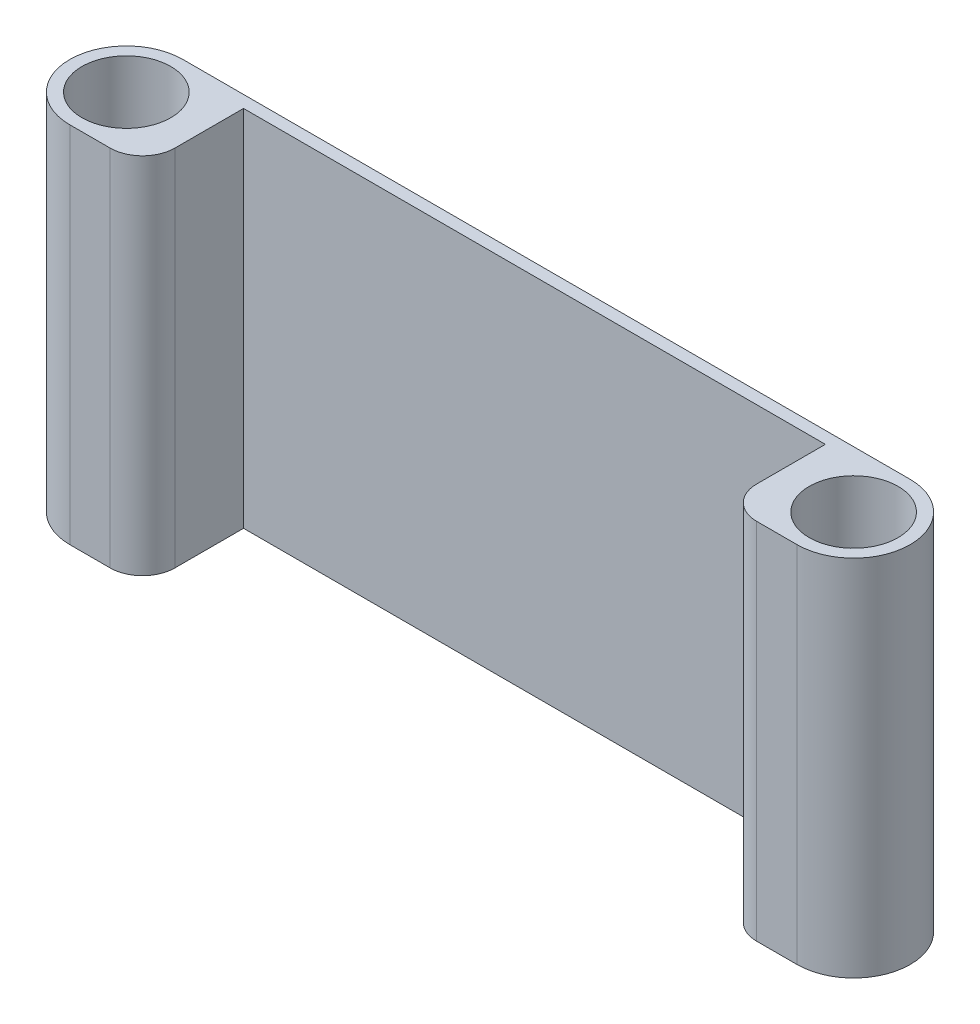
ISO-10303-21;
HEADER;
FILE_DESCRIPTION(('STEP AP214'),'2;1');
FILE_NAME('part.step','',(''),(''),'','','');
FILE_SCHEMA(('AUTOMOTIVE_DESIGN { 1 0 10303 214 1 1 1 1 }'));
ENDSEC;
DATA;
#1=APPLICATION_CONTEXT('core data for automotive mechanical design processes');
#2=APPLICATION_PROTOCOL_DEFINITION('international standard','automotive_design',2000,#1);
#3=PRODUCT_CONTEXT('',#1,'mechanical');
#4=PRODUCT('Part','Part','',(#3));
#5=PRODUCT_RELATED_PRODUCT_CATEGORY('part','',(#4));
#6=PRODUCT_DEFINITION_FORMATION('','',#4);
#7=PRODUCT_DEFINITION_CONTEXT('part definition',#1,'design');
#8=PRODUCT_DEFINITION('design','',#6,#7);
#9=PRODUCT_DEFINITION_SHAPE('','',#8);
#10=(LENGTH_UNIT() NAMED_UNIT(*) SI_UNIT(.MILLI.,.METRE.));
#11=(NAMED_UNIT(*) PLANE_ANGLE_UNIT() SI_UNIT($,.RADIAN.));
#12=(NAMED_UNIT(*) SI_UNIT($,.STERADIAN.) SOLID_ANGLE_UNIT());
#13=UNCERTAINTY_MEASURE_WITH_UNIT(LENGTH_MEASURE(1.E-05),#10,'distance_accuracy_value','');
#14=(GEOMETRIC_REPRESENTATION_CONTEXT(3) GLOBAL_UNCERTAINTY_ASSIGNED_CONTEXT((#13)) GLOBAL_UNIT_ASSIGNED_CONTEXT((#10,
#11,#12)) REPRESENTATION_CONTEXT('',''));
#15=CARTESIAN_POINT('',(0.,0.,0.));
#16=DIRECTION('',(0.,0.,1.));
#17=DIRECTION('',(1.,0.,0.));
#18=AXIS2_PLACEMENT_3D('',#15,#16,#17);
#19=CARTESIAN_POINT('',(-42.5394184422842,90.,0.499999999999994));
#20=DIRECTION('',(0.,-1.,0.));
#21=DIRECTION('',(0.,0.,-1.));
#22=AXIS2_PLACEMENT_3D('',#19,#20,#21);
#23=PLANE('',#22);
#24=DIRECTION('',(0.,0.,1.));
#25=VECTOR('',#24,1.);
#26=CARTESIAN_POINT('',(119.460581557716,90.,14.5));
#27=LINE('',#26,#25);
#28=CARTESIAN_POINT('',(119.460581557716,90.,-10.5));
#29=VERTEX_POINT('',#28);
#30=CARTESIAN_POINT('',(119.460581557716,90.,6.50000000000001));
#31=VERTEX_POINT('',#30);
#32=EDGE_CURVE('E189',#29,#31,#27,.T.);
#33=ORIENTED_EDGE('',*,*,#32,.T.);
#34=CARTESIAN_POINT('',(127.460581557716,90.,6.50000000000001));
#35=DIRECTION('',(0.,-1.,0.));
#36=DIRECTION('',(0.,0.,-1.));
#37=AXIS2_PLACEMENT_3D('',#34,#35,#36);
#38=CIRCLE('',#37,8.);
#39=CARTESIAN_POINT('',(127.460581557716,90.,14.5));
#40=VERTEX_POINT('',#39);
#41=EDGE_CURVE('E146',#31,#40,#38,.F.);
#42=ORIENTED_EDGE('',*,*,#41,.T.);
#43=DIRECTION('',(1.,0.,0.));
#44=VECTOR('',#43,1.);
#45=CARTESIAN_POINT('',(137.460581557716,90.,14.5));
#46=LINE('',#45,#44);
#47=CARTESIAN_POINT('',(137.460581557716,90.,14.5));
#48=VERTEX_POINT('',#47);
#49=EDGE_CURVE('E201',#40,#48,#46,.T.);
#50=ORIENTED_EDGE('',*,*,#49,.T.);
#51=CARTESIAN_POINT('',(137.460581557716,90.,0.499999999999994));
#52=DIRECTION('',(0.,1.,0.));
#53=DIRECTION('',(0.,0.,-1.));
#54=AXIS2_PLACEMENT_3D('',#51,#52,#53);
#55=CIRCLE('',#54,14.);
#56=CARTESIAN_POINT('',(137.460581557716,90.,-13.5));
#57=VERTEX_POINT('',#56);
#58=EDGE_CURVE('E203',#48,#57,#55,.T.);
#59=ORIENTED_EDGE('',*,*,#58,.T.);
#60=DIRECTION('',(-1.,0.,0.));
#61=VECTOR('',#60,1.);
#62=CARTESIAN_POINT('',(-42.5394184422842,90.,-13.5));
#63=LINE('',#62,#61);
#64=CARTESIAN_POINT('',(-42.5394184422842,90.,-13.5));
#65=VERTEX_POINT('',#64);
#66=EDGE_CURVE('E120',#57,#65,#63,.T.);
#67=ORIENTED_EDGE('',*,*,#66,.T.);
#68=CARTESIAN_POINT('',(-42.5394184422842,90.,0.499999999999994));
#69=DIRECTION('',(0.,1.,0.));
#70=DIRECTION('',(0.,0.,-1.));
#71=AXIS2_PLACEMENT_3D('',#68,#69,#70);
#72=CIRCLE('',#71,14.);
#73=CARTESIAN_POINT('',(-42.5394184422842,90.,14.5));
#74=VERTEX_POINT('',#73);
#75=EDGE_CURVE('E114',#65,#74,#72,.T.);
#76=ORIENTED_EDGE('',*,*,#75,.T.);
#77=DIRECTION('',(1.,0.,0.));
#78=VECTOR('',#77,1.);
#79=CARTESIAN_POINT('',(-42.5394184422842,90.,14.5));
#80=LINE('',#79,#78);
#81=CARTESIAN_POINT('',(-32.5394184422842,90.,14.5));
#82=VERTEX_POINT('',#81);
#83=EDGE_CURVE('E107',#74,#82,#80,.T.);
#84=ORIENTED_EDGE('',*,*,#83,.T.);
#85=CARTESIAN_POINT('',(-32.5394184422842,90.,6.5));
#86=DIRECTION('',(0.,-1.,0.));
#87=DIRECTION('',(0.,0.,-1.));
#88=AXIS2_PLACEMENT_3D('',#85,#86,#87);
#89=CIRCLE('',#88,8.);
#90=CARTESIAN_POINT('',(-24.5394184422842,90.,6.5));
#91=VERTEX_POINT('',#90);
#92=EDGE_CURVE('E48',#82,#91,#89,.F.);
#93=ORIENTED_EDGE('',*,*,#92,.T.);
#94=DIRECTION('',(0.,0.,-1.));
#95=VECTOR('',#94,1.);
#96=CARTESIAN_POINT('',(-24.5394184422842,90.,14.5));
#97=LINE('',#96,#95);
#98=CARTESIAN_POINT('',(-24.5394184422842,90.,-10.5));
#99=VERTEX_POINT('',#98);
#100=EDGE_CURVE('E113',#91,#99,#97,.T.);
#101=ORIENTED_EDGE('',*,*,#100,.T.);
#102=DIRECTION('',(1.,0.,0.));
#103=VECTOR('',#102,1.);
#104=CARTESIAN_POINT('',(119.460581557716,90.,-10.5));
#105=LINE('',#104,#103);
#106=EDGE_CURVE('E206',#99,#29,#105,.T.);
#107=ORIENTED_EDGE('',*,*,#106,.T.);
#108=EDGE_LOOP('',(#33,#42,#50,#59,#67,#76,#84,#93,#101,#107));
#109=FACE_BOUND('',#108,.T.);
#110=CARTESIAN_POINT('',(-42.5394184422842,90.,0.499999999999994));
#111=DIRECTION('',(0.,1.,0.));
#112=DIRECTION('',(0.,0.,1.));
#113=AXIS2_PLACEMENT_3D('',#110,#111,#112);
#114=CIRCLE('',#113,11.);
#115=CARTESIAN_POINT('',(-42.5394184422842,90.,11.5));
#116=VERTEX_POINT('',#115);
#117=EDGE_CURVE('E210',#116,#116,#114,.T.);
#118=ORIENTED_EDGE('',*,*,#117,.F.);
#119=EDGE_LOOP('',(#118));
#120=FACE_BOUND('',#119,.T.);
#121=CARTESIAN_POINT('',(137.460581557716,90.,0.499999999999994));
#122=DIRECTION('',(0.,1.,0.));
#123=DIRECTION('',(0.,0.,1.));
#124=AXIS2_PLACEMENT_3D('',#121,#122,#123);
#125=CIRCLE('',#124,11.);
#126=CARTESIAN_POINT('',(137.460581557716,90.,11.5));
#127=VERTEX_POINT('',#126);
#128=EDGE_CURVE('E217',#127,#127,#125,.T.);
#129=ORIENTED_EDGE('',*,*,#128,.F.);
#130=EDGE_LOOP('',(#129));
#131=FACE_BOUND('',#130,.T.);
#132=ADVANCED_FACE('F33',(#109,#120,#131),#23,.F.);
#133=CARTESIAN_POINT('',(-42.5394184422842,0.,0.499999999999994));
#134=DIRECTION('',(0.,-1.,0.));
#135=DIRECTION('',(0.,0.,-1.));
#136=AXIS2_PLACEMENT_3D('',#133,#134,#135);
#137=PLANE('',#136);
#138=CARTESIAN_POINT('',(-42.5394184422842,0.,0.499999999999994));
#139=DIRECTION('',(0.,1.,0.));
#140=DIRECTION('',(0.,0.,1.));
#141=AXIS2_PLACEMENT_3D('',#138,#139,#140);
#142=CIRCLE('',#141,11.);
#143=CARTESIAN_POINT('',(-42.5394184422842,0.,11.5));
#144=VERTEX_POINT('',#143);
#145=EDGE_CURVE('E212',#144,#144,#142,.T.);
#146=ORIENTED_EDGE('',*,*,#145,.T.);
#147=EDGE_LOOP('',(#146));
#148=FACE_BOUND('',#147,.T.);
#149=DIRECTION('',(1.,0.,0.));
#150=VECTOR('',#149,1.);
#151=CARTESIAN_POINT('',(137.460581557716,0.,14.5));
#152=LINE('',#151,#150);
#153=CARTESIAN_POINT('',(127.460581557716,0.,14.5));
#154=VERTEX_POINT('',#153);
#155=CARTESIAN_POINT('',(137.460581557716,0.,14.5));
#156=VERTEX_POINT('',#155);
#157=EDGE_CURVE('E171',#154,#156,#152,.T.);
#158=ORIENTED_EDGE('',*,*,#157,.F.);
#159=CARTESIAN_POINT('',(127.460581557716,0.,6.50000000000001));
#160=DIRECTION('',(0.,-1.,0.));
#161=DIRECTION('',(0.,0.,-1.));
#162=AXIS2_PLACEMENT_3D('',#159,#160,#161);
#163=CIRCLE('',#162,8.);
#164=CARTESIAN_POINT('',(119.460581557716,0.,6.50000000000001));
#165=VERTEX_POINT('',#164);
#166=EDGE_CURVE('E141',#154,#165,#163,.T.);
#167=ORIENTED_EDGE('',*,*,#166,.T.);
#168=DIRECTION('',(0.,0.,1.));
#169=VECTOR('',#168,1.);
#170=CARTESIAN_POINT('',(119.460581557716,0.,14.5));
#171=LINE('',#170,#169);
#172=CARTESIAN_POINT('',(119.460581557716,0.,-10.5));
#173=VERTEX_POINT('',#172);
#174=EDGE_CURVE('E164',#173,#165,#171,.T.);
#175=ORIENTED_EDGE('',*,*,#174,.F.);
#176=DIRECTION('',(1.,0.,0.));
#177=VECTOR('',#176,1.);
#178=CARTESIAN_POINT('',(119.460581557716,0.,-10.5));
#179=LINE('',#178,#177);
#180=CARTESIAN_POINT('',(-24.5394184422842,0.,-10.5));
#181=VERTEX_POINT('',#180);
#182=EDGE_CURVE('E161',#181,#173,#179,.T.);
#183=ORIENTED_EDGE('',*,*,#182,.F.);
#184=DIRECTION('',(0.,0.,-1.));
#185=VECTOR('',#184,1.);
#186=CARTESIAN_POINT('',(-24.5394184422842,0.,14.5));
#187=LINE('',#186,#185);
#188=CARTESIAN_POINT('',(-24.5394184422842,0.,6.5));
#189=VERTEX_POINT('',#188);
#190=EDGE_CURVE('E153',#189,#181,#187,.T.);
#191=ORIENTED_EDGE('',*,*,#190,.F.);
#192=CARTESIAN_POINT('',(-32.5394184422842,0.,6.5));
#193=DIRECTION('',(0.,-1.,0.));
#194=DIRECTION('',(0.,0.,-1.));
#195=AXIS2_PLACEMENT_3D('',#192,#193,#194);
#196=CIRCLE('',#195,8.);
#197=CARTESIAN_POINT('',(-32.5394184422842,0.,14.5));
#198=VERTEX_POINT('',#197);
#199=EDGE_CURVE('E133',#189,#198,#196,.T.);
#200=ORIENTED_EDGE('',*,*,#199,.T.);
#201=DIRECTION('',(1.,0.,0.));
#202=VECTOR('',#201,1.);
#203=CARTESIAN_POINT('',(-42.5394184422842,0.,14.5));
#204=LINE('',#203,#202);
#205=CARTESIAN_POINT('',(-42.5394184422842,0.,14.5));
#206=VERTEX_POINT('',#205);
#207=EDGE_CURVE('E162',#206,#198,#204,.T.);
#208=ORIENTED_EDGE('',*,*,#207,.F.);
#209=CARTESIAN_POINT('',(-42.5394184422842,0.,0.499999999999994));
#210=DIRECTION('',(0.,1.,0.));
#211=DIRECTION('',(0.,0.,-1.));
#212=AXIS2_PLACEMENT_3D('',#209,#210,#211);
#213=CIRCLE('',#212,14.);
#214=CARTESIAN_POINT('',(-42.5394184422842,0.,-13.5));
#215=VERTEX_POINT('',#214);
#216=EDGE_CURVE('E128',#215,#206,#213,.T.);
#217=ORIENTED_EDGE('',*,*,#216,.F.);
#218=DIRECTION('',(-1.,0.,0.));
#219=VECTOR('',#218,1.);
#220=CARTESIAN_POINT('',(-42.5394184422842,0.,-13.5));
#221=LINE('',#220,#219);
#222=CARTESIAN_POINT('',(137.460581557716,0.,-13.5));
#223=VERTEX_POINT('',#222);
#224=EDGE_CURVE('E124',#223,#215,#221,.T.);
#225=ORIENTED_EDGE('',*,*,#224,.F.);
#226=CARTESIAN_POINT('',(137.460581557716,0.,0.499999999999994));
#227=DIRECTION('',(0.,1.,0.));
#228=DIRECTION('',(0.,0.,-1.));
#229=AXIS2_PLACEMENT_3D('',#226,#227,#228);
#230=CIRCLE('',#229,14.);
#231=EDGE_CURVE('E173',#156,#223,#230,.T.);
#232=ORIENTED_EDGE('',*,*,#231,.F.);
#233=EDGE_LOOP('',(#158,#167,#175,#183,#191,#200,#208,#217,#225,#232));
#234=FACE_BOUND('',#233,.T.);
#235=CARTESIAN_POINT('',(137.460581557716,0.,0.499999999999994));
#236=DIRECTION('',(0.,1.,0.));
#237=DIRECTION('',(0.,0.,1.));
#238=AXIS2_PLACEMENT_3D('',#235,#236,#237);
#239=CIRCLE('',#238,11.);
#240=CARTESIAN_POINT('',(137.460581557716,0.,11.5));
#241=VERTEX_POINT('',#240);
#242=EDGE_CURVE('E220',#241,#241,#239,.T.);
#243=ORIENTED_EDGE('',*,*,#242,.T.);
#244=EDGE_LOOP('',(#243));
#245=FACE_BOUND('',#244,.T.);
#246=ADVANCED_FACE('F158',(#148,#234,#245),#137,.T.);
#247=CARTESIAN_POINT('',(-42.5394184422842,90.,0.499999999999994));
#248=DIRECTION('',(0.,-1.,0.));
#249=DIRECTION('',(0.,0.,-1.));
#250=AXIS2_PLACEMENT_3D('',#247,#248,#249);
#251=CYLINDRICAL_SURFACE('',#250,14.);
#252=ORIENTED_EDGE('',*,*,#216,.T.);
#253=DIRECTION('',(0.,-1.,0.));
#254=VECTOR('',#253,1.);
#255=CARTESIAN_POINT('',(-42.5394184422842,90.,14.5));
#256=LINE('',#255,#254);
#257=EDGE_CURVE('E111',#74,#206,#256,.T.);
#258=ORIENTED_EDGE('',*,*,#257,.F.);
#259=ORIENTED_EDGE('',*,*,#75,.F.);
#260=DIRECTION('',(0.,-1.,0.));
#261=VECTOR('',#260,1.);
#262=CARTESIAN_POINT('',(-42.5394184422842,90.,-13.5));
#263=LINE('',#262,#261);
#264=EDGE_CURVE('E176',#65,#215,#263,.T.);
#265=ORIENTED_EDGE('',*,*,#264,.T.);
#266=EDGE_LOOP('',(#252,#258,#259,#265));
#267=FACE_BOUND('',#266,.T.);
#268=ADVANCED_FACE('F126',(#267),#251,.T.);
#269=CARTESIAN_POINT('',(-42.5394184422842,90.,14.5));
#270=DIRECTION('',(0.,0.,-1.));
#271=DIRECTION('',(-1.,0.,0.));
#272=AXIS2_PLACEMENT_3D('',#269,#270,#271);
#273=PLANE('',#272);
#274=ORIENTED_EDGE('',*,*,#207,.T.);
#275=DIRECTION('',(0.,-1.,0.));
#276=VECTOR('',#275,1.);
#277=CARTESIAN_POINT('',(-32.5394184422842,90.,14.5));
#278=LINE('',#277,#276);
#279=EDGE_CURVE('E11',#198,#82,#278,.F.);
#280=ORIENTED_EDGE('',*,*,#279,.T.);
#281=ORIENTED_EDGE('',*,*,#83,.F.);
#282=ORIENTED_EDGE('',*,*,#257,.T.);
#283=EDGE_LOOP('',(#274,#280,#281,#282));
#284=FACE_BOUND('',#283,.T.);
#285=ADVANCED_FACE('F109',(#284),#273,.F.);
#286=CARTESIAN_POINT('',(-24.5394184422842,90.,14.5));
#287=DIRECTION('',(-1.,0.,0.));
#288=DIRECTION('',(0.,0.,1.));
#289=AXIS2_PLACEMENT_3D('',#286,#287,#288);
#290=PLANE('',#289);
#291=ORIENTED_EDGE('',*,*,#100,.F.);
#292=DIRECTION('',(0.,-1.,0.));
#293=VECTOR('',#292,1.);
#294=CARTESIAN_POINT('',(-24.5394184422842,90.,6.5));
#295=LINE('',#294,#293);
#296=EDGE_CURVE('E41',#91,#189,#295,.T.);
#297=ORIENTED_EDGE('',*,*,#296,.T.);
#298=ORIENTED_EDGE('',*,*,#190,.T.);
#299=DIRECTION('',(0.,-1.,0.));
#300=VECTOR('',#299,1.);
#301=CARTESIAN_POINT('',(-24.5394184422842,90.,-10.5));
#302=LINE('',#301,#300);
#303=EDGE_CURVE('E130',#99,#181,#302,.T.);
#304=ORIENTED_EDGE('',*,*,#303,.F.);
#305=EDGE_LOOP('',(#291,#297,#298,#304));
#306=FACE_BOUND('',#305,.T.);
#307=ADVANCED_FACE('F151',(#306),#290,.F.);
#308=CARTESIAN_POINT('',(119.460581557716,90.,-10.5));
#309=DIRECTION('',(0.,0.,-1.));
#310=DIRECTION('',(-1.,0.,0.));
#311=AXIS2_PLACEMENT_3D('',#308,#309,#310);
#312=PLANE('',#311);
#313=ORIENTED_EDGE('',*,*,#182,.T.);
#314=DIRECTION('',(0.,-1.,0.));
#315=VECTOR('',#314,1.);
#316=CARTESIAN_POINT('',(119.460581557716,90.,-10.5));
#317=LINE('',#316,#315);
#318=EDGE_CURVE('E136',#29,#173,#317,.T.);
#319=ORIENTED_EDGE('',*,*,#318,.F.);
#320=ORIENTED_EDGE('',*,*,#106,.F.);
#321=ORIENTED_EDGE('',*,*,#303,.T.);
#322=EDGE_LOOP('',(#313,#319,#320,#321));
#323=FACE_BOUND('',#322,.T.);
#324=ADVANCED_FACE('F223',(#323),#312,.F.);
#325=CARTESIAN_POINT('',(119.460581557716,90.,14.5));
#326=DIRECTION('',(1.,0.,0.));
#327=DIRECTION('',(0.,0.,-1.));
#328=AXIS2_PLACEMENT_3D('',#325,#326,#327);
#329=PLANE('',#328);
#330=ORIENTED_EDGE('',*,*,#174,.T.);
#331=DIRECTION('',(0.,-1.,0.));
#332=VECTOR('',#331,1.);
#333=CARTESIAN_POINT('',(119.460581557716,90.,6.50000000000001));
#334=LINE('',#333,#332);
#335=EDGE_CURVE('E143',#165,#31,#334,.F.);
#336=ORIENTED_EDGE('',*,*,#335,.T.);
#337=ORIENTED_EDGE('',*,*,#32,.F.);
#338=ORIENTED_EDGE('',*,*,#318,.T.);
#339=EDGE_LOOP('',(#330,#336,#337,#338));
#340=FACE_BOUND('',#339,.T.);
#341=ADVANCED_FACE('F187',(#340),#329,.F.);
#342=CARTESIAN_POINT('',(137.460581557716,90.,14.5));
#343=DIRECTION('',(0.,0.,-1.));
#344=DIRECTION('',(-1.,0.,0.));
#345=AXIS2_PLACEMENT_3D('',#342,#343,#344);
#346=PLANE('',#345);
#347=ORIENTED_EDGE('',*,*,#49,.F.);
#348=DIRECTION('',(0.,-1.,0.));
#349=VECTOR('',#348,1.);
#350=CARTESIAN_POINT('',(127.460581557716,90.,14.5));
#351=LINE('',#350,#349);
#352=EDGE_CURVE('E129',#40,#154,#351,.T.);
#353=ORIENTED_EDGE('',*,*,#352,.T.);
#354=ORIENTED_EDGE('',*,*,#157,.T.);
#355=DIRECTION('',(0.,-1.,0.));
#356=VECTOR('',#355,1.);
#357=CARTESIAN_POINT('',(137.460581557716,90.,14.5));
#358=LINE('',#357,#356);
#359=EDGE_CURVE('E181',#48,#156,#358,.T.);
#360=ORIENTED_EDGE('',*,*,#359,.F.);
#361=EDGE_LOOP('',(#347,#353,#354,#360));
#362=FACE_BOUND('',#361,.T.);
#363=ADVANCED_FACE('F199',(#362),#346,.F.);
#364=CARTESIAN_POINT('',(137.460581557716,90.,0.499999999999994));
#365=DIRECTION('',(0.,-1.,0.));
#366=DIRECTION('',(0.,0.,-1.));
#367=AXIS2_PLACEMENT_3D('',#364,#365,#366);
#368=CYLINDRICAL_SURFACE('',#367,14.);
#369=ORIENTED_EDGE('',*,*,#231,.T.);
#370=DIRECTION('',(0.,-1.,0.));
#371=VECTOR('',#370,1.);
#372=CARTESIAN_POINT('',(137.460581557716,90.,-13.5));
#373=LINE('',#372,#371);
#374=EDGE_CURVE('E178',#57,#223,#373,.T.);
#375=ORIENTED_EDGE('',*,*,#374,.F.);
#376=ORIENTED_EDGE('',*,*,#58,.F.);
#377=ORIENTED_EDGE('',*,*,#359,.T.);
#378=EDGE_LOOP('',(#369,#375,#376,#377));
#379=FACE_BOUND('',#378,.T.);
#380=ADVANCED_FACE('F246',(#379),#368,.T.);
#381=CARTESIAN_POINT('',(-42.5394184422842,90.,-13.5));
#382=DIRECTION('',(0.,0.,1.));
#383=DIRECTION('',(1.,0.,0.));
#384=AXIS2_PLACEMENT_3D('',#381,#382,#383);
#385=PLANE('',#384);
#386=ORIENTED_EDGE('',*,*,#224,.T.);
#387=ORIENTED_EDGE('',*,*,#264,.F.);
#388=ORIENTED_EDGE('',*,*,#66,.F.);
#389=ORIENTED_EDGE('',*,*,#374,.T.);
#390=EDGE_LOOP('',(#386,#387,#388,#389));
#391=FACE_BOUND('',#390,.T.);
#392=ADVANCED_FACE('F243',(#391),#385,.F.);
#393=CARTESIAN_POINT('',(-42.5394184422842,90.,0.499999999999994));
#394=DIRECTION('',(0.,-1.,0.));
#395=DIRECTION('',(0.,0.,-1.));
#396=AXIS2_PLACEMENT_3D('',#393,#394,#395);
#397=CYLINDRICAL_SURFACE('',#396,11.);
#398=ORIENTED_EDGE('',*,*,#117,.T.);
#399=EDGE_LOOP('',(#398));
#400=FACE_BOUND('',#399,.T.);
#401=ORIENTED_EDGE('',*,*,#145,.F.);
#402=EDGE_LOOP('',(#401));
#403=FACE_BOUND('',#402,.T.);
#404=ADVANCED_FACE('F240',(#400,#403),#397,.F.);
#405=CARTESIAN_POINT('',(137.460581557716,90.,0.499999999999994));
#406=DIRECTION('',(0.,-1.,0.));
#407=DIRECTION('',(0.,0.,-1.));
#408=AXIS2_PLACEMENT_3D('',#405,#406,#407);
#409=CYLINDRICAL_SURFACE('',#408,11.);
#410=ORIENTED_EDGE('',*,*,#128,.T.);
#411=EDGE_LOOP('',(#410));
#412=FACE_BOUND('',#411,.T.);
#413=ORIENTED_EDGE('',*,*,#242,.F.);
#414=EDGE_LOOP('',(#413));
#415=FACE_BOUND('',#414,.T.);
#416=ADVANCED_FACE('F271',(#412,#415),#409,.F.);
#417=CARTESIAN_POINT('',(127.460581557716,90.,6.50000000000001));
#418=DIRECTION('',(0.,-1.,0.));
#419=DIRECTION('',(0.,0.,-1.));
#420=AXIS2_PLACEMENT_3D('',#417,#418,#419);
#421=CYLINDRICAL_SURFACE('',#420,8.);
#422=ORIENTED_EDGE('',*,*,#41,.F.);
#423=ORIENTED_EDGE('',*,*,#335,.F.);
#424=ORIENTED_EDGE('',*,*,#166,.F.);
#425=ORIENTED_EDGE('',*,*,#352,.F.);
#426=EDGE_LOOP('',(#422,#423,#424,#425));
#427=FACE_BOUND('',#426,.T.);
#428=ADVANCED_FACE('F196',(#427),#421,.T.);
#429=CARTESIAN_POINT('',(-32.5394184422842,90.,6.5));
#430=DIRECTION('',(0.,-1.,0.));
#431=DIRECTION('',(0.,0.,-1.));
#432=AXIS2_PLACEMENT_3D('',#429,#430,#431);
#433=CYLINDRICAL_SURFACE('',#432,8.);
#434=ORIENTED_EDGE('',*,*,#92,.F.);
#435=ORIENTED_EDGE('',*,*,#279,.F.);
#436=ORIENTED_EDGE('',*,*,#199,.F.);
#437=ORIENTED_EDGE('',*,*,#296,.F.);
#438=EDGE_LOOP('',(#434,#435,#436,#437));
#439=FACE_BOUND('',#438,.T.);
#440=ADVANCED_FACE('F35',(#439),#433,.T.);
#441=CLOSED_SHELL('',(#132,#246,#268,#285,#307,#324,#341,#363,#380,#392,#404,#416,#428,#440));
#442=MANIFOLD_SOLID_BREP('B2',#441);
#443=ADVANCED_BREP_SHAPE_REPRESENTATION('',(#18,#442),#14);
#444=SHAPE_DEFINITION_REPRESENTATION(#9,#443);
ENDSEC;
END-ISO-10303-21;
